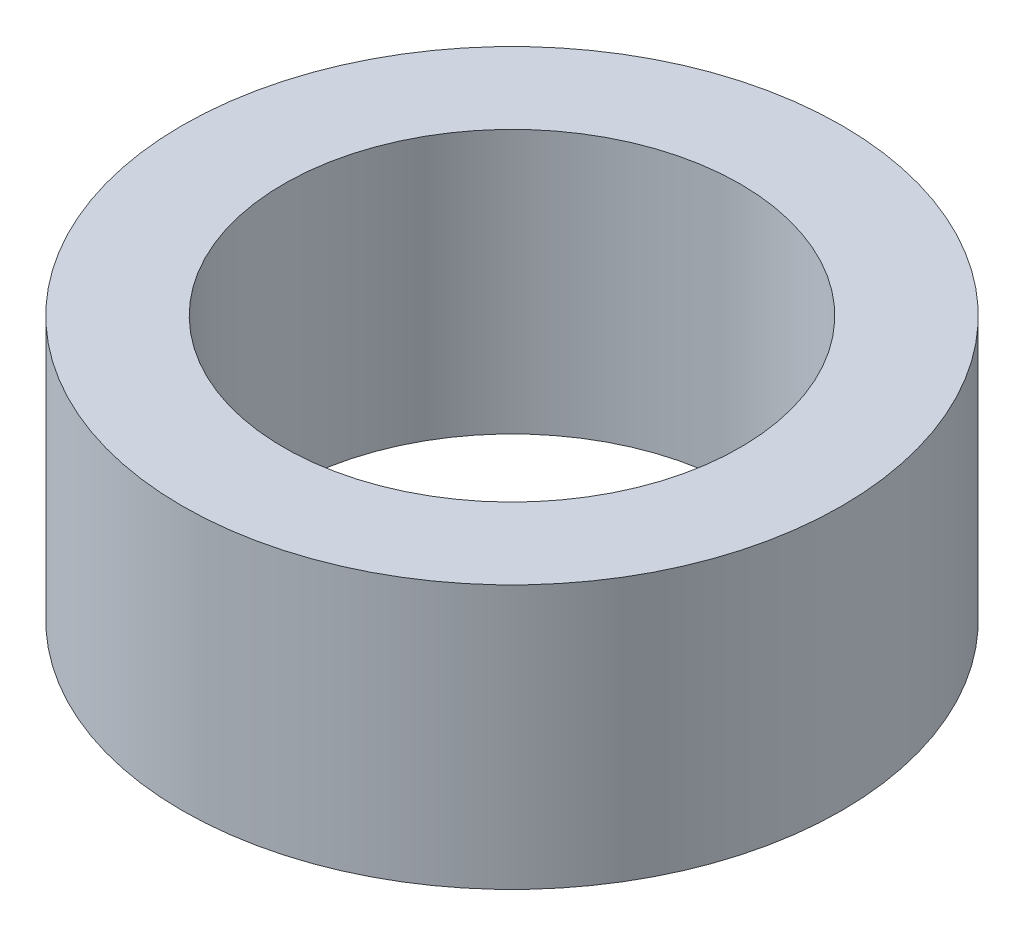
ISO-10303-21;
HEADER;
FILE_DESCRIPTION(('STEP AP214'),'2;1');
FILE_NAME('part.step','',(''),(''),'','','');
FILE_SCHEMA(('AUTOMOTIVE_DESIGN { 1 0 10303 214 1 1 1 1 }'));
ENDSEC;
DATA;
#1=APPLICATION_CONTEXT('core data for automotive mechanical design processes');
#2=APPLICATION_PROTOCOL_DEFINITION('international standard','automotive_design',2000,#1);
#3=PRODUCT_CONTEXT('',#1,'mechanical');
#4=PRODUCT('Part','Part','',(#3));
#5=PRODUCT_RELATED_PRODUCT_CATEGORY('part','',(#4));
#6=PRODUCT_DEFINITION_FORMATION('','',#4);
#7=PRODUCT_DEFINITION_CONTEXT('part definition',#1,'design');
#8=PRODUCT_DEFINITION('design','',#6,#7);
#9=PRODUCT_DEFINITION_SHAPE('','',#8);
#10=(LENGTH_UNIT() NAMED_UNIT(*) SI_UNIT(.MILLI.,.METRE.));
#11=(NAMED_UNIT(*) PLANE_ANGLE_UNIT() SI_UNIT($,.RADIAN.));
#12=(NAMED_UNIT(*) SI_UNIT($,.STERADIAN.) SOLID_ANGLE_UNIT());
#13=UNCERTAINTY_MEASURE_WITH_UNIT(LENGTH_MEASURE(1.E-05),#10,'distance_accuracy_value','');
#14=(GEOMETRIC_REPRESENTATION_CONTEXT(3) GLOBAL_UNCERTAINTY_ASSIGNED_CONTEXT((#13)) GLOBAL_UNIT_ASSIGNED_CONTEXT((#10,
#11,#12)) REPRESENTATION_CONTEXT('',''));
#15=CARTESIAN_POINT('',(0.,0.,0.));
#16=DIRECTION('',(0.,0.,1.));
#17=DIRECTION('',(1.,0.,0.));
#18=AXIS2_PLACEMENT_3D('',#15,#16,#17);
#19=CARTESIAN_POINT('',(0.,26.,0.));
#20=DIRECTION('',(0.,-1.,0.));
#21=DIRECTION('',(0.,0.,-1.));
#22=AXIS2_PLACEMENT_3D('',#19,#20,#21);
#23=CYLINDRICAL_SURFACE('',#22,32.5);
#24=CARTESIAN_POINT('',(0.,26.,0.));
#25=DIRECTION('',(0.,1.,0.));
#26=DIRECTION('',(0.,0.,1.));
#27=AXIS2_PLACEMENT_3D('',#24,#25,#26);
#28=CIRCLE('',#27,32.5);
#29=CARTESIAN_POINT('',(0.,26.,-32.5));
#30=VERTEX_POINT('',#29);
#31=EDGE_CURVE('E10',#30,#30,#28,.T.);
#32=CARTESIAN_POINT('',(0.,0.,0.));
#33=DIRECTION('',(0.,1.,0.));
#34=DIRECTION('',(0.,0.,1.));
#35=AXIS2_PLACEMENT_3D('',#32,#33,#34);
#36=CIRCLE('',#35,32.5);
#37=CARTESIAN_POINT('',(0.,0.,-32.5));
#38=VERTEX_POINT('',#37);
#39=EDGE_CURVE('E37',#38,#38,#36,.T.);
#40=CARTESIAN_POINT('',(0.,26.,-32.5));
#41=CARTESIAN_POINT('',(0.,25.7291666666667,-32.5));
#42=CARTESIAN_POINT('',(0.,25.4583333333333,-32.5));
#43=CARTESIAN_POINT('',(0.,24.9166666666667,-32.5));
#44=CARTESIAN_POINT('',(0.,24.6458333333333,-32.5));
#45=CARTESIAN_POINT('',(0.,24.1041666666667,-32.5));
#46=CARTESIAN_POINT('',(0.,23.8333333333333,-32.5));
#47=CARTESIAN_POINT('',(0.,23.2916666666667,-32.5));
#48=CARTESIAN_POINT('',(0.,23.0208333333333,-32.5));
#49=CARTESIAN_POINT('',(0.,22.4791666666667,-32.5));
#50=CARTESIAN_POINT('',(0.,22.2083333333333,-32.5));
#51=CARTESIAN_POINT('',(0.,21.6666666666667,-32.5));
#52=CARTESIAN_POINT('',(0.,21.3958333333333,-32.5));
#53=CARTESIAN_POINT('',(0.,20.8541666666667,-32.5));
#54=CARTESIAN_POINT('',(0.,20.5833333333333,-32.5));
#55=CARTESIAN_POINT('',(0.,20.0416666666667,-32.5));
#56=CARTESIAN_POINT('',(0.,19.7708333333333,-32.5));
#57=CARTESIAN_POINT('',(0.,19.2291666666667,-32.5));
#58=CARTESIAN_POINT('',(0.,18.9583333333333,-32.5));
#59=CARTESIAN_POINT('',(0.,18.4166666666667,-32.5));
#60=CARTESIAN_POINT('',(0.,18.1458333333333,-32.5));
#61=CARTESIAN_POINT('',(0.,17.6041666666667,-32.5));
#62=CARTESIAN_POINT('',(0.,17.3333333333333,-32.5));
#63=CARTESIAN_POINT('',(0.,16.7916666666667,-32.5));
#64=CARTESIAN_POINT('',(0.,16.5208333333333,-32.5));
#65=CARTESIAN_POINT('',(0.,15.9791666666667,-32.5));
#66=CARTESIAN_POINT('',(0.,15.7083333333333,-32.5));
#67=CARTESIAN_POINT('',(0.,15.1666666666667,-32.5));
#68=CARTESIAN_POINT('',(0.,14.8958333333333,-32.5));
#69=CARTESIAN_POINT('',(0.,14.3541666666667,-32.5));
#70=CARTESIAN_POINT('',(0.,14.0833333333333,-32.5));
#71=CARTESIAN_POINT('',(0.,13.5416666666667,-32.5));
#72=CARTESIAN_POINT('',(0.,13.2708333333333,-32.5));
#73=CARTESIAN_POINT('',(0.,12.7291666666667,-32.5));
#74=CARTESIAN_POINT('',(0.,12.4583333333333,-32.5));
#75=CARTESIAN_POINT('',(0.,11.9166666666667,-32.5));
#76=CARTESIAN_POINT('',(0.,11.6458333333333,-32.5));
#77=CARTESIAN_POINT('',(0.,11.1041666666667,-32.5));
#78=CARTESIAN_POINT('',(0.,10.8333333333333,-32.5));
#79=CARTESIAN_POINT('',(0.,10.2916666666667,-32.5));
#80=CARTESIAN_POINT('',(0.,10.0208333333333,-32.5));
#81=CARTESIAN_POINT('',(0.,9.47916666666667,-32.5));
#82=CARTESIAN_POINT('',(0.,9.20833333333333,-32.5));
#83=CARTESIAN_POINT('',(0.,8.66666666666667,-32.5));
#84=CARTESIAN_POINT('',(0.,8.39583333333333,-32.5));
#85=CARTESIAN_POINT('',(0.,7.85416666666667,-32.5));
#86=CARTESIAN_POINT('',(0.,7.58333333333333,-32.5));
#87=CARTESIAN_POINT('',(0.,7.04166666666667,-32.5));
#88=CARTESIAN_POINT('',(0.,6.77083333333333,-32.5));
#89=CARTESIAN_POINT('',(0.,6.22916666666667,-32.5));
#90=CARTESIAN_POINT('',(0.,5.95833333333333,-32.5));
#91=CARTESIAN_POINT('',(0.,5.41666666666667,-32.5));
#92=CARTESIAN_POINT('',(0.,5.14583333333333,-32.5));
#93=CARTESIAN_POINT('',(0.,4.60416666666667,-32.5));
#94=CARTESIAN_POINT('',(0.,4.33333333333333,-32.5));
#95=CARTESIAN_POINT('',(0.,3.79166666666667,-32.5));
#96=CARTESIAN_POINT('',(0.,3.52083333333333,-32.5));
#97=CARTESIAN_POINT('',(0.,2.97916666666667,-32.5));
#98=CARTESIAN_POINT('',(0.,2.70833333333333,-32.5));
#99=CARTESIAN_POINT('',(0.,2.16666666666667,-32.5));
#100=CARTESIAN_POINT('',(0.,1.89583333333333,-32.5));
#101=CARTESIAN_POINT('',(0.,1.35416666666667,-32.5));
#102=CARTESIAN_POINT('',(0.,1.08333333333333,-32.5));
#103=CARTESIAN_POINT('',(0.,0.541666666666667,-32.5));
#104=CARTESIAN_POINT('',(0.,0.270833333333334,-32.5));
#105=CARTESIAN_POINT('',(0.,0.,-32.5));
#106=B_SPLINE_CURVE_WITH_KNOTS('',3,(#40,#41,#42,#43,#44,#45,#46,#47,#48,#49,#50,#51,#52,#53,
#54,#55,#56,#57,#58,#59,#60,#61,#62,#63,#64,#65,#66,#67,#68,#69,#70,#71,#72,#73,#74,#75,#76,#77,
#78,#79,#80,#81,#82,#83,#84,#85,#86,#87,#88,#89,#90,#91,#92,#93,#94,#95,#96,#97,#98,#99,#100,
#101,#102,#103,#104,#105),.UNSPECIFIED.,.F.,.F.,(4,2,2,2,2,2,2,2,2,2,2,2,2,2,2,2,2,2,2,2,2,2,2,
2,2,2,2,2,2,2,2,2,4),(0.,0.812500000000001,1.625,2.4375,3.25,4.0625,4.875,5.6875,6.5,7.3125,
8.125,8.9375,9.75,10.5625,11.375,12.1875,13.,13.8125,14.625,15.4375,16.25,17.0625,17.875,
18.6875,19.5,20.3125,21.125,21.9375,22.75,23.5625,24.375,25.1875,26.),.UNSPECIFIED.);
#107=EDGE_CURVE('BSEAM40',#30,#38,#106,.T.);
#108=ORIENTED_EDGE('',*,*,#31,.F.);
#109=ORIENTED_EDGE('',*,*,#39,.T.);
#110=ORIENTED_EDGE('',*,*,#107,.T.);
#111=ORIENTED_EDGE('',*,*,#107,.F.);
#112=EDGE_LOOP('',(#108,#110,#109,#111));
#113=FACE_BOUND('',#112,.T.);
#114=ADVANCED_FACE('F40',(#113),#23,.T.);
#115=CARTESIAN_POINT('',(0.,26.,0.));
#116=DIRECTION('',(0.,1.,0.));
#117=DIRECTION('',(0.,0.,1.));
#118=AXIS2_PLACEMENT_3D('',#115,#116,#117);
#119=PLANE('',#118);
#120=CARTESIAN_POINT('',(0.,26.,0.));
#121=DIRECTION('',(0.,1.,0.));
#122=DIRECTION('',(0.,0.,1.));
#123=AXIS2_PLACEMENT_3D('',#120,#121,#122);
#124=CIRCLE('',#123,22.5);
#125=CARTESIAN_POINT('',(0.,26.,-22.5));
#126=VERTEX_POINT('',#125);
#127=EDGE_CURVE('E50',#126,#126,#124,.T.);
#128=ORIENTED_EDGE('',*,*,#127,.F.);
#129=EDGE_LOOP('',(#128));
#130=FACE_BOUND('',#129,.T.);
#131=ORIENTED_EDGE('',*,*,#31,.T.);
#132=EDGE_LOOP('',(#131));
#133=FACE_BOUND('',#132,.T.);
#134=ADVANCED_FACE('F59',(#130,#133),#119,.T.);
#135=CARTESIAN_POINT('',(0.,0.,0.));
#136=DIRECTION('',(0.,1.,0.));
#137=DIRECTION('',(0.,0.,1.));
#138=AXIS2_PLACEMENT_3D('',#135,#136,#137);
#139=PLANE('',#138);
#140=CARTESIAN_POINT('',(0.,0.,0.));
#141=DIRECTION('',(0.,1.,0.));
#142=DIRECTION('',(0.,0.,1.));
#143=AXIS2_PLACEMENT_3D('',#140,#141,#142);
#144=CIRCLE('',#143,22.5);
#145=CARTESIAN_POINT('',(0.,0.,-22.5));
#146=VERTEX_POINT('',#145);
#147=EDGE_CURVE('E47',#146,#146,#144,.T.);
#148=ORIENTED_EDGE('',*,*,#147,.T.);
#149=EDGE_LOOP('',(#148));
#150=FACE_BOUND('',#149,.T.);
#151=ORIENTED_EDGE('',*,*,#39,.F.);
#152=EDGE_LOOP('',(#151));
#153=FACE_BOUND('',#152,.T.);
#154=ADVANCED_FACE('F58',(#150,#153),#139,.F.);
#155=CARTESIAN_POINT('',(0.,26.,0.));
#156=DIRECTION('',(0.,-1.,0.));
#157=DIRECTION('',(0.,0.,-1.));
#158=AXIS2_PLACEMENT_3D('',#155,#156,#157);
#159=CYLINDRICAL_SURFACE('',#158,22.5);
#160=CARTESIAN_POINT('',(0.,26.,-22.5));
#161=CARTESIAN_POINT('',(0.,25.7291666666667,-22.5));
#162=CARTESIAN_POINT('',(0.,25.4583333333333,-22.5));
#163=CARTESIAN_POINT('',(0.,24.9166666666667,-22.5));
#164=CARTESIAN_POINT('',(0.,24.6458333333333,-22.5));
#165=CARTESIAN_POINT('',(0.,24.1041666666667,-22.5));
#166=CARTESIAN_POINT('',(0.,23.8333333333333,-22.5));
#167=CARTESIAN_POINT('',(0.,23.2916666666667,-22.5));
#168=CARTESIAN_POINT('',(0.,23.0208333333333,-22.5));
#169=CARTESIAN_POINT('',(0.,22.4791666666667,-22.5));
#170=CARTESIAN_POINT('',(0.,22.2083333333333,-22.5));
#171=CARTESIAN_POINT('',(0.,21.6666666666667,-22.5));
#172=CARTESIAN_POINT('',(0.,21.3958333333333,-22.5));
#173=CARTESIAN_POINT('',(0.,20.8541666666667,-22.5));
#174=CARTESIAN_POINT('',(0.,20.5833333333333,-22.5));
#175=CARTESIAN_POINT('',(0.,20.0416666666667,-22.5));
#176=CARTESIAN_POINT('',(0.,19.7708333333333,-22.5));
#177=CARTESIAN_POINT('',(0.,19.2291666666667,-22.5));
#178=CARTESIAN_POINT('',(0.,18.9583333333333,-22.5));
#179=CARTESIAN_POINT('',(0.,18.4166666666667,-22.5));
#180=CARTESIAN_POINT('',(0.,18.1458333333333,-22.5));
#181=CARTESIAN_POINT('',(0.,17.6041666666667,-22.5));
#182=CARTESIAN_POINT('',(0.,17.3333333333333,-22.5));
#183=CARTESIAN_POINT('',(0.,16.7916666666667,-22.5));
#184=CARTESIAN_POINT('',(0.,16.5208333333333,-22.5));
#185=CARTESIAN_POINT('',(0.,15.9791666666667,-22.5));
#186=CARTESIAN_POINT('',(0.,15.7083333333333,-22.5));
#187=CARTESIAN_POINT('',(0.,15.1666666666667,-22.5));
#188=CARTESIAN_POINT('',(0.,14.8958333333333,-22.5));
#189=CARTESIAN_POINT('',(0.,14.3541666666667,-22.5));
#190=CARTESIAN_POINT('',(0.,14.0833333333333,-22.5));
#191=CARTESIAN_POINT('',(0.,13.5416666666667,-22.5));
#192=CARTESIAN_POINT('',(0.,13.2708333333333,-22.5));
#193=CARTESIAN_POINT('',(0.,12.7291666666667,-22.5));
#194=CARTESIAN_POINT('',(0.,12.4583333333333,-22.5));
#195=CARTESIAN_POINT('',(0.,11.9166666666667,-22.5));
#196=CARTESIAN_POINT('',(0.,11.6458333333333,-22.5));
#197=CARTESIAN_POINT('',(0.,11.1041666666667,-22.5));
#198=CARTESIAN_POINT('',(0.,10.8333333333333,-22.5));
#199=CARTESIAN_POINT('',(0.,10.2916666666667,-22.5));
#200=CARTESIAN_POINT('',(0.,10.0208333333333,-22.5));
#201=CARTESIAN_POINT('',(0.,9.47916666666667,-22.5));
#202=CARTESIAN_POINT('',(0.,9.20833333333333,-22.5));
#203=CARTESIAN_POINT('',(0.,8.66666666666667,-22.5));
#204=CARTESIAN_POINT('',(0.,8.39583333333333,-22.5));
#205=CARTESIAN_POINT('',(0.,7.85416666666667,-22.5));
#206=CARTESIAN_POINT('',(0.,7.58333333333333,-22.5));
#207=CARTESIAN_POINT('',(0.,7.04166666666667,-22.5));
#208=CARTESIAN_POINT('',(0.,6.77083333333333,-22.5));
#209=CARTESIAN_POINT('',(0.,6.22916666666667,-22.5));
#210=CARTESIAN_POINT('',(0.,5.95833333333333,-22.5));
#211=CARTESIAN_POINT('',(0.,5.41666666666667,-22.5));
#212=CARTESIAN_POINT('',(0.,5.14583333333333,-22.5));
#213=CARTESIAN_POINT('',(0.,4.60416666666667,-22.5));
#214=CARTESIAN_POINT('',(0.,4.33333333333333,-22.5));
#215=CARTESIAN_POINT('',(0.,3.79166666666667,-22.5));
#216=CARTESIAN_POINT('',(0.,3.52083333333333,-22.5));
#217=CARTESIAN_POINT('',(0.,2.97916666666667,-22.5));
#218=CARTESIAN_POINT('',(0.,2.70833333333333,-22.5));
#219=CARTESIAN_POINT('',(0.,2.16666666666667,-22.5));
#220=CARTESIAN_POINT('',(0.,1.89583333333333,-22.5));
#221=CARTESIAN_POINT('',(0.,1.35416666666667,-22.5));
#222=CARTESIAN_POINT('',(0.,1.08333333333333,-22.5));
#223=CARTESIAN_POINT('',(0.,0.541666666666667,-22.5));
#224=CARTESIAN_POINT('',(0.,0.270833333333334,-22.5));
#225=CARTESIAN_POINT('',(0.,0.,-22.5));
#226=B_SPLINE_CURVE_WITH_KNOTS('',3,(#160,#161,#162,#163,#164,#165,#166,#167,#168,#169,#170,
#171,#172,#173,#174,#175,#176,#177,#178,#179,#180,#181,#182,#183,#184,#185,#186,#187,#188,#189,
#190,#191,#192,#193,#194,#195,#196,#197,#198,#199,#200,#201,#202,#203,#204,#205,#206,#207,#208,
#209,#210,#211,#212,#213,#214,#215,#216,#217,#218,#219,#220,#221,#222,#223,#224,#225),
.UNSPECIFIED.,.F.,.F.,(4,2,2,2,2,2,2,2,2,2,2,2,2,2,2,2,2,2,2,2,2,2,2,2,2,2,2,2,2,2,2,2,4),(0.,
0.812499999999997,1.625,2.4375,3.25,4.0625,4.875,5.6875,6.5,7.3125,8.125,8.93749999999999,
9.74999999999999,10.5625,11.375,12.1875,13.,13.8125,14.625,15.4375,16.25,17.0625,17.875,18.6875,
19.5,20.3125,21.125,21.9375,22.75,23.5625,24.375,25.1875,26.),.UNSPECIFIED.);
#227=EDGE_CURVE('BSEAM54',#126,#146,#226,.T.);
#228=ORIENTED_EDGE('',*,*,#127,.T.);
#229=ORIENTED_EDGE('',*,*,#147,.F.);
#230=ORIENTED_EDGE('',*,*,#227,.T.);
#231=ORIENTED_EDGE('',*,*,#227,.F.);
#232=EDGE_LOOP('',(#228,#230,#229,#231));
#233=FACE_BOUND('',#232,.T.);
#234=ADVANCED_FACE('F54',(#233),#159,.F.);
#235=CLOSED_SHELL('',(#114,#134,#154,#234));
#236=MANIFOLD_SOLID_BREP('B2',#235);
#237=ADVANCED_BREP_SHAPE_REPRESENTATION('',(#18,#236),#14);
#238=SHAPE_DEFINITION_REPRESENTATION(#9,#237);
ENDSEC;
END-ISO-10303-21;
